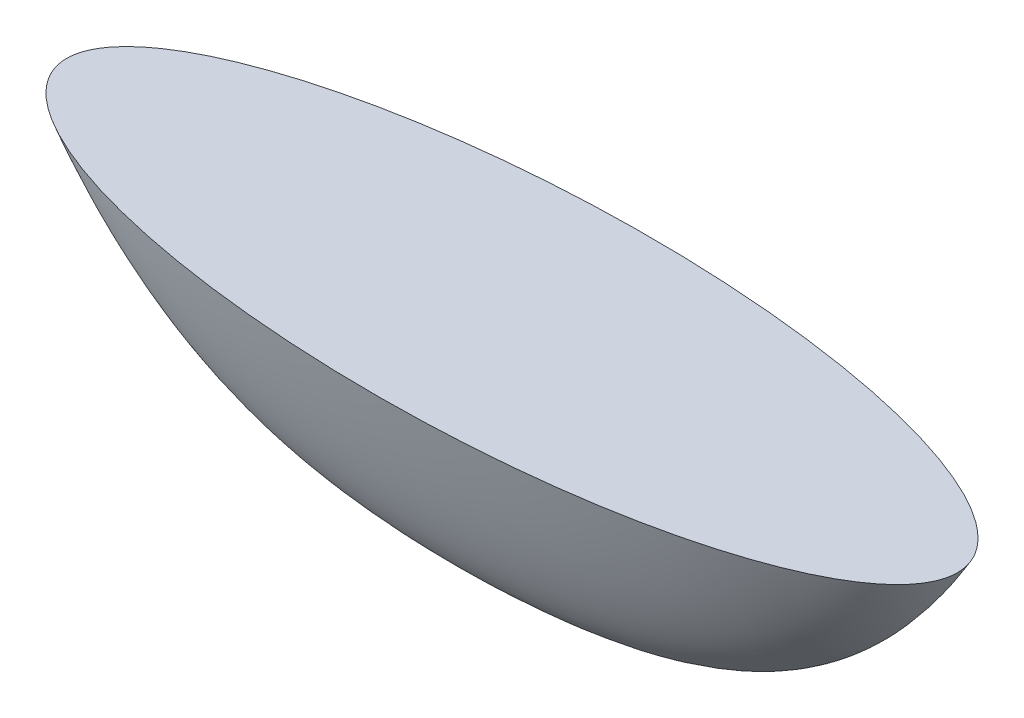
ISO-10303-21;
HEADER;
FILE_DESCRIPTION(('STEP AP214'),'2;1');
FILE_NAME('part.step','',(''),(''),'','','');
FILE_SCHEMA(('AUTOMOTIVE_DESIGN { 1 0 10303 214 1 1 1 1 }'));
ENDSEC;
DATA;
#1=APPLICATION_CONTEXT('core data for automotive mechanical design processes');
#2=APPLICATION_PROTOCOL_DEFINITION('international standard','automotive_design',2000,#1);
#3=PRODUCT_CONTEXT('',#1,'mechanical');
#4=PRODUCT('Part','Part','',(#3));
#5=PRODUCT_RELATED_PRODUCT_CATEGORY('part','',(#4));
#6=PRODUCT_DEFINITION_FORMATION('','',#4);
#7=PRODUCT_DEFINITION_CONTEXT('part definition',#1,'design');
#8=PRODUCT_DEFINITION('design','',#6,#7);
#9=PRODUCT_DEFINITION_SHAPE('','',#8);
#10=(LENGTH_UNIT() NAMED_UNIT(*) SI_UNIT(.MILLI.,.METRE.));
#11=(NAMED_UNIT(*) PLANE_ANGLE_UNIT() SI_UNIT($,.RADIAN.));
#12=(NAMED_UNIT(*) SI_UNIT($,.STERADIAN.) SOLID_ANGLE_UNIT());
#13=UNCERTAINTY_MEASURE_WITH_UNIT(LENGTH_MEASURE(1.E-05),#10,'distance_accuracy_value','');
#14=(GEOMETRIC_REPRESENTATION_CONTEXT(3) GLOBAL_UNCERTAINTY_ASSIGNED_CONTEXT((#13)) GLOBAL_UNIT_ASSIGNED_CONTEXT((#10,
#11,#12)) REPRESENTATION_CONTEXT('',''));
#15=CARTESIAN_POINT('',(0.,0.,0.));
#16=DIRECTION('',(0.,0.,1.));
#17=DIRECTION('',(1.,0.,0.));
#18=AXIS2_PLACEMENT_3D('',#15,#16,#17);
#19=CARTESIAN_POINT('',(0.,0.,0.));
#20=DIRECTION('',(0.,1.,0.));
#21=DIRECTION('',(-0.999851906711521,0.,0.0172094347767901));
#22=AXIS2_PLACEMENT_3D('',#19,#20,#21);
#23=PLANE('',#22);
#24=CARTESIAN_POINT('',(0.,0.,0.));
#25=VERTEX_POINT('',#24);
#26=VERTEX_LOOP('',#25);
#27=FACE_BOUND('',#26,.T.);
#28=CARTESIAN_POINT('',(0.,0.,0.));
#29=DIRECTION('',(0.,1.,0.));
#30=DIRECTION('',(-1.,0.,0.));
#31=AXIS2_PLACEMENT_3D('',#28,#29,#30);
#32=ELLIPSE('',#31,126.332421280006,38.8621430938494);
#33=CARTESIAN_POINT('',(-126.332421280006,0.,0.));
#34=VERTEX_POINT('',#33);
#35=EDGE_CURVE('E12',#34,#34,#32,.F.);
#36=ORIENTED_EDGE('',*,*,#35,.F.);
#37=EDGE_LOOP('',(#36));
#38=FACE_BOUND('',#37,.T.);
#39=ADVANCED_FACE('F219',(#27,#38),#23,.T.);
#40=CARTESIAN_POINT('',(-126.332421280006,0.,0.));
#41=CARTESIAN_POINT('',(-126.332421280006,0.,-0.724055720101464));
#42=CARTESIAN_POINT('',(-126.200860463796,0.,-2.17216716030439));
#43=CARTESIAN_POINT('',(-125.624698431712,0.,-4.27431763432497));
#44=CARTESIAN_POINT('',(-124.735718070539,0.,-6.2618180611774));
#45=CARTESIAN_POINT('',(-123.594716131777,0.,-8.11477548266345));
#46=CARTESIAN_POINT('',(-122.263209540154,0.,-9.83381615985682));
#47=CARTESIAN_POINT('',(-120.784667540636,0.,-11.4274833469121));
#48=CARTESIAN_POINT('',(-119.19397952282,0.,-12.9081222923523));
#49=CARTESIAN_POINT('',(-117.515189885834,0.,-14.2877678439713));
#50=CARTESIAN_POINT('',(-115.767106827956,0.,-15.5778467488719));
#51=CARTESIAN_POINT('',(-113.361189302801,0.,-17.1912359068653));
#52=CARTESIAN_POINT('',(-110.24049192765,0.,-19.0300917021699));
#53=CARTESIAN_POINT('',(-106.369906509327,0.,-21.0055987276352));
#54=CARTESIAN_POINT('',(-102.407507402115,0.,-22.7887468978894));
#55=CARTESIAN_POINT('',(-98.375965941823,0.,-24.4085858566371));
#56=CARTESIAN_POINT('',(-94.2906740634178,0.,-25.8871272813768));
#57=CARTESIAN_POINT('',(-90.1627119084947,0.,-27.2415166582752));
#58=CARTESIAN_POINT('',(-86.0001699883612,0.,-28.4852858201645));
#59=CARTESIAN_POINT('',(-81.8091941219328,0.,-29.6293297569872));
#60=CARTESIAN_POINT('',(-77.5945154366875,0.,-30.6825180132609));
#61=CARTESIAN_POINT('',(-73.3598781238327,0.,-31.6521784658335));
#62=CARTESIAN_POINT('',(-69.1082785471845,0.,-32.5444060360376));
#63=CARTESIAN_POINT('',(-64.8421724468865,0.,-33.3643455629932));
#64=CARTESIAN_POINT('',(-60.5635756165023,0.,-34.1163153375473));
#65=CARTESIAN_POINT('',(-56.2742087639832,0.,-34.804061849312));
#66=CARTESIAN_POINT('',(-50.5425720598916,0.,-35.6395309329596));
#67=CARTESIAN_POINT('',(-43.3578628253521,0.,-36.5381110423666));
#68=CARTESIAN_POINT('',(-34.7120526797566,0.,-37.4005087071854));
#69=CARTESIAN_POINT('',(-26.0484320277335,0.,-38.0595871907003));
#70=CARTESIAN_POINT('',(-17.3722649729313,0.,-38.524382198873));
#71=CARTESIAN_POINT('',(-8.68808456938262,0.,-38.8009359050651));
#72=CARTESIAN_POINT('',(1.52655665885959E-13,0.,-38.8927421977586));
#73=CARTESIAN_POINT('',(8.68808456938294,0.,-38.8009359050652));
#74=CARTESIAN_POINT('',(17.3722649729316,0.,-38.5243821988729));
#75=CARTESIAN_POINT('',(26.0484320277337,0.,-38.0595871907006));
#76=CARTESIAN_POINT('',(34.7120526797569,0.,-37.4005087071854));
#77=CARTESIAN_POINT('',(43.3578628253524,0.,-36.5381110423669));
#78=CARTESIAN_POINT('',(50.542572059892,0.,-35.6395309329597));
#79=CARTESIAN_POINT('',(56.2742087639834,0.,-34.8040618493122));
#80=CARTESIAN_POINT('',(60.5635756165026,0.,-34.1163153375475));
#81=CARTESIAN_POINT('',(64.8421724468867,0.,-33.3643455629935));
#82=CARTESIAN_POINT('',(69.1082785471846,0.,-32.5444060360379));
#83=CARTESIAN_POINT('',(73.359878123833,0.,-31.6521784658337));
#84=CARTESIAN_POINT('',(77.5945154366875,0.,-30.6825180132612));
#85=CARTESIAN_POINT('',(81.8091941219333,0.,-29.6293297569875));
#86=CARTESIAN_POINT('',(86.0001699883613,0.,-28.4852858201648));
#87=CARTESIAN_POINT('',(90.1627119084951,0.,-27.2415166582755));
#88=CARTESIAN_POINT('',(94.290674063418,0.,-25.8871272813771));
#89=CARTESIAN_POINT('',(98.3759659418232,0.,-24.4085858566375));
#90=CARTESIAN_POINT('',(102.407507402115,0.,-22.7887468978896));
#91=CARTESIAN_POINT('',(106.369906509328,0.,-21.0055987276356));
#92=CARTESIAN_POINT('',(110.24049192765,0.,-19.0300917021702));
#93=CARTESIAN_POINT('',(113.361189302801,0.,-17.1912359068657));
#94=CARTESIAN_POINT('',(115.767106827956,0.,-15.5778467488723));
#95=CARTESIAN_POINT('',(117.515189885834,0.,-14.2877678439717));
#96=CARTESIAN_POINT('',(119.19397952282,0.,-12.9081222923526));
#97=CARTESIAN_POINT('',(120.784667540636,0.,-11.4274833469123));
#98=CARTESIAN_POINT('',(122.263209540154,0.,-9.83381615985712));
#99=CARTESIAN_POINT('',(123.594716131778,0.,-8.11477548266365));
#100=CARTESIAN_POINT('',(124.735718070539,0.,-6.26181806117768));
#101=CARTESIAN_POINT('',(125.624698431712,0.,-4.27431763432524));
#102=CARTESIAN_POINT('',(126.200860463796,0.,-2.17216716030483));
#103=CARTESIAN_POINT('',(126.398201688111,0.,-4.38875840262687E-13));
#104=CARTESIAN_POINT('',(126.200860463796,0.,2.17216716030395));
#105=CARTESIAN_POINT('',(125.624698431712,0.,4.27431763432453));
#106=CARTESIAN_POINT('',(124.735718070538,0.,6.26181806117695));
#107=CARTESIAN_POINT('',(123.594716131777,0.,8.11477548266304));
#108=CARTESIAN_POINT('',(122.263209540154,0.,9.83381615985638));
#109=CARTESIAN_POINT('',(120.784667540636,0.,11.4274833469116));
#110=CARTESIAN_POINT('',(119.19397952282,0.,12.9081222923519));
#111=CARTESIAN_POINT('',(117.515189885834,0.,14.2877678439709));
#112=CARTESIAN_POINT('',(115.767106827956,0.,15.5778467488715));
#113=CARTESIAN_POINT('',(113.361189302801,0.,17.1912359068649));
#114=CARTESIAN_POINT('',(110.24049192765,0.,19.0300917021694));
#115=CARTESIAN_POINT('',(106.369906509327,0.,21.0055987276348));
#116=CARTESIAN_POINT('',(102.407507402115,0.,22.7887468978889));
#117=CARTESIAN_POINT('',(98.375965941823,0.,24.4085858566367));
#118=CARTESIAN_POINT('',(94.2906740634178,0.,25.8871272813765));
#119=CARTESIAN_POINT('',(90.1627119084948,0.,27.2415166582747));
#120=CARTESIAN_POINT('',(86.0001699883611,0.,28.4852858201642));
#121=CARTESIAN_POINT('',(81.8091941219329,0.,29.6293297569867));
#122=CARTESIAN_POINT('',(77.5945154366874,0.,30.6825180132605));
#123=CARTESIAN_POINT('',(73.3598781238327,0.,31.652178465833));
#124=CARTESIAN_POINT('',(69.1082785471844,0.,32.5444060360373));
#125=CARTESIAN_POINT('',(64.8421724468865,0.,33.3643455629927));
#126=CARTESIAN_POINT('',(60.5635756165023,0.,34.116315337547));
#127=CARTESIAN_POINT('',(56.2742087639831,0.,34.8040618493115));
#128=CARTESIAN_POINT('',(50.5425720598916,0.,35.6395309329592));
#129=CARTESIAN_POINT('',(43.3578628253519,0.,36.5381110423661));
#130=CARTESIAN_POINT('',(34.7120526797566,0.,37.400508707185));
#131=CARTESIAN_POINT('',(26.0484320277333,0.,38.0595871906999));
#132=CARTESIAN_POINT('',(17.3722649729313,0.,38.5243821988725));
#133=CARTESIAN_POINT('',(8.68808456938255,0.,38.8009359050647));
#134=CARTESIAN_POINT('',(-2.63677968348475E-13,0.,38.8927421977582));
#135=CARTESIAN_POINT('',(-8.68808456938301,0.,38.8009359050647));
#136=CARTESIAN_POINT('',(-17.3722649729317,0.,38.5243821988725));
#137=CARTESIAN_POINT('',(-26.0484320277337,0.,38.0595871907001));
#138=CARTESIAN_POINT('',(-34.712052679757,0.,37.400508707185));
#139=CARTESIAN_POINT('',(-43.3578628253523,0.,36.5381110423664));
#140=CARTESIAN_POINT('',(-50.542572059892,0.,35.6395309329593));
#141=CARTESIAN_POINT('',(-56.2742087639834,0.,34.8040618493118));
#142=CARTESIAN_POINT('',(-60.5635756165026,0.,34.1163153375471));
#143=CARTESIAN_POINT('',(-64.8421724468865,0.,33.3643455629931));
#144=CARTESIAN_POINT('',(-69.1082785471847,0.,32.5444060360375));
#145=CARTESIAN_POINT('',(-73.3598781238329,0.,31.6521784658333));
#146=CARTESIAN_POINT('',(-77.5945154366875,0.,30.6825180132607));
#147=CARTESIAN_POINT('',(-81.8091941219333,0.,29.629329756987));
#148=CARTESIAN_POINT('',(-86.0001699883613,0.,28.4852858201644));
#149=CARTESIAN_POINT('',(-90.162711908495,0.,27.241516658275));
#150=CARTESIAN_POINT('',(-94.2906740634182,0.,25.8871272813768));
#151=CARTESIAN_POINT('',(-98.375965941823,0.,24.408585856637));
#152=CARTESIAN_POINT('',(-102.407507402115,0.,22.7887468978892));
#153=CARTESIAN_POINT('',(-106.369906509328,0.,21.0055987276351));
#154=CARTESIAN_POINT('',(-110.24049192765,0.,19.0300917021698));
#155=CARTESIAN_POINT('',(-113.361189302801,0.,17.1912359068653));
#156=CARTESIAN_POINT('',(-115.767106827956,0.,15.5778467488718));
#157=CARTESIAN_POINT('',(-117.515189885834,0.,14.2877678439713));
#158=CARTESIAN_POINT('',(-119.19397952282,0.,12.9081222923521));
#159=CARTESIAN_POINT('',(-120.784667540636,0.,11.4274833469119));
#160=CARTESIAN_POINT('',(-122.263209540154,0.,9.83381615985668));
#161=CARTESIAN_POINT('',(-123.594716131777,0.,8.11477548266324));
#162=CARTESIAN_POINT('',(-124.735718070539,0.,6.26181806117721));
#163=CARTESIAN_POINT('',(-125.624698431712,0.,4.27431763432481));
#164=CARTESIAN_POINT('',(-126.200860463796,0.,2.17216716030439));
#165=CARTESIAN_POINT('',(-126.332421280006,0.,0.724055720101464));
#166=CARTESIAN_POINT('',(-126.332421280006,0.,0.));
#167=CARTESIAN_POINT('',(-97.7223167634216,-47.3587167274026,0.));
#168=CARTESIAN_POINT('',(-97.7223167634216,-47.3587167274026,-0.458568622730927));
#169=CARTESIAN_POINT('',(-97.6346707473142,-47.3587167274026,-1.37570586819278));
#170=CARTESIAN_POINT('',(-97.2505120759822,-47.3587167274026,-2.70706783507248));
#171=CARTESIAN_POINT('',(-96.6556680225836,-47.3587167274026,-3.96581810541235));
#172=CARTESIAN_POINT('',(-95.8888458916771,-47.3587167274026,-5.13935780568685));
#173=CARTESIAN_POINT('',(-94.9892090975291,-47.3587167274026,-6.22808356790932));
#174=CARTESIAN_POINT('',(-93.9844908572264,-47.3587167274026,-7.23740611971097));
#175=CARTESIAN_POINT('',(-92.8969904794535,-47.3587167274026,-8.1751441184898));
#176=CARTESIAN_POINT('',(-91.7421387789327,-47.3587167274026,-9.04891963451517));
#177=CARTESIAN_POINT('',(-90.5320503098468,-47.3587167274026,-9.86596960761887));
#178=CARTESIAN_POINT('',(-88.8561459583732,-47.3587167274026,-10.8877827410147));
#179=CARTESIAN_POINT('',(-86.6621446935528,-47.3587167274026,-12.0523914113743));
#180=CARTESIAN_POINT('',(-83.9075417989917,-47.3587167274026,-13.3035458608356));
#181=CARTESIAN_POINT('',(-81.0542511800381,-47.3587167274026,-14.43287303533));
#182=CARTESIAN_POINT('',(-78.1182529115623,-47.3587167274026,-15.4587710425369));
#183=CARTESIAN_POINT('',(-75.1109167812333,-47.3587167274026,-16.3951806115387));
#184=CARTESIAN_POINT('',(-72.0408817742519,-47.3587167274026,-17.252960550241));
#185=CARTESIAN_POINT('',(-68.9148934433035,-47.3587167274026,-18.0406810194376));
#186=CARTESIAN_POINT('',(-65.7384657025584,-47.3587167274026,-18.7652421794252));
#187=CARTESIAN_POINT('',(-62.5162164949429,-47.3587167274026,-19.4322614083986));
#188=CARTESIAN_POINT('',(-59.252138703746,-47.3587167274026,-20.0463796950279));
#189=CARTESIAN_POINT('',(-55.9497515882413,-47.3587167274026,-20.6114571561572));
#190=CARTESIAN_POINT('',(-52.6122320127106,-47.3587167274026,-21.1307521898957));
#191=CARTESIAN_POINT('',(-49.242478208601,-47.3587167274026,-21.60699971378));
#192=CARTESIAN_POINT('',(-45.8432015198057,-47.3587167274026,-22.0425725045643));
#193=CARTESIAN_POINT('',(-41.2748209529793,-47.3587167274026,-22.5717029242078));
#194=CARTESIAN_POINT('',(-35.5029282542621,-47.3587167274026,-23.1408036601655));
#195=CARTESIAN_POINT('',(-28.4964937875544,-47.3587167274026,-23.6869888478842));
#196=CARTESIAN_POINT('',(-21.4268893433466,-47.3587167274026,-24.1044052207769));
#197=CARTESIAN_POINT('',(-14.3104213514734,-47.3587167274026,-24.3987753926196));
#198=CARTESIAN_POINT('',(-7.16293324367945,-47.3587167274026,-24.573926073208));
#199=CARTESIAN_POINT('',(0.,-47.3587167274026,-24.6320700585805));
#200=CARTESIAN_POINT('',(7.16293324367962,-47.3587167274026,-24.573926073208));
#201=CARTESIAN_POINT('',(14.3104213514736,-47.3587167274026,-24.3987753926196));
#202=CARTESIAN_POINT('',(21.4268893433467,-47.3587167274026,-24.1044052207771));
#203=CARTESIAN_POINT('',(28.4964937875545,-47.3587167274026,-23.6869888478842));
#204=CARTESIAN_POINT('',(35.5029282542622,-47.3587167274026,-23.1408036601658));
#205=CARTESIAN_POINT('',(41.2748209529795,-47.3587167274026,-22.5717029242079));
#206=CARTESIAN_POINT('',(45.8432015198059,-47.3587167274026,-22.0425725045645));
#207=CARTESIAN_POINT('',(49.2424782086012,-47.3587167274026,-21.6069997137802));
#208=CARTESIAN_POINT('',(52.6122320127107,-47.3587167274026,-21.130752189896));
#209=CARTESIAN_POINT('',(55.9497515882414,-47.3587167274026,-20.6114571561575));
#210=CARTESIAN_POINT('',(59.2521387037461,-47.3587167274026,-20.0463796950281));
#211=CARTESIAN_POINT('',(62.516216494943,-47.3587167274026,-19.4322614083989));
#212=CARTESIAN_POINT('',(65.7384657025586,-47.3587167274026,-18.7652421794255));
#213=CARTESIAN_POINT('',(68.9148934433035,-47.3587167274026,-18.0406810194378));
#214=CARTESIAN_POINT('',(72.0408817742521,-47.3587167274026,-17.2529605502413));
#215=CARTESIAN_POINT('',(75.1109167812334,-47.3587167274026,-16.395180611539));
#216=CARTESIAN_POINT('',(78.1182529115625,-47.3587167274026,-15.4587710425372));
#217=CARTESIAN_POINT('',(81.0542511800381,-47.3587167274026,-14.4328730353302));
#218=CARTESIAN_POINT('',(83.9075417989919,-47.3587167274026,-13.303545860836));
#219=CARTESIAN_POINT('',(86.6621446935528,-47.3587167274026,-12.0523914113746));
#220=CARTESIAN_POINT('',(88.8561459583735,-47.3587167274026,-10.8877827410151));
#221=CARTESIAN_POINT('',(90.5320503098468,-47.3587167274026,-9.86596960761922));
#222=CARTESIAN_POINT('',(91.7421387789328,-47.3587167274026,-9.04891963451554));
#223=CARTESIAN_POINT('',(92.8969904794536,-47.3587167274026,-8.17514411849012));
#224=CARTESIAN_POINT('',(93.9844908572265,-47.3587167274026,-7.23740611971127));
#225=CARTESIAN_POINT('',(94.9892090975291,-47.3587167274026,-6.22808356790964));
#226=CARTESIAN_POINT('',(95.8888458916773,-47.3587167274026,-5.1393578056871));
#227=CARTESIAN_POINT('',(96.6556680225837,-47.3587167274026,-3.96581810541265));
#228=CARTESIAN_POINT('',(97.2505120759822,-47.3587167274026,-2.70706783507278));
#229=CARTESIAN_POINT('',(97.6346707473142,-47.3587167274026,-1.37570586819318));
#230=CARTESIAN_POINT('',(97.7661397714753,-47.3587167274026,-4.01642969347202E-13));
#231=CARTESIAN_POINT('',(97.6346707473143,-47.3587167274026,1.37570586819238));
#232=CARTESIAN_POINT('',(97.2505120759823,-47.3587167274026,2.70706783507208));
#233=CARTESIAN_POINT('',(96.6556680225836,-47.3587167274026,3.96581810541195));
#234=CARTESIAN_POINT('',(95.8888458916771,-47.3587167274026,5.13935780568647));
#235=CARTESIAN_POINT('',(94.9892090975292,-47.3587167274026,6.22808356790892));
#236=CARTESIAN_POINT('',(93.9844908572263,-47.3587167274026,7.23740611971057));
#237=CARTESIAN_POINT('',(92.8969904794536,-47.3587167274026,8.17514411848941));
#238=CARTESIAN_POINT('',(91.7421387789328,-47.3587167274026,9.04891963451477));
#239=CARTESIAN_POINT('',(90.5320503098466,-47.3587167274026,9.86596960761848));
#240=CARTESIAN_POINT('',(88.8561459583734,-47.3587167274026,10.8877827410143));
#241=CARTESIAN_POINT('',(86.6621446935527,-47.3587167274026,12.0523914113738));
#242=CARTESIAN_POINT('',(83.9075417989917,-47.3587167274026,13.3035458608353));
#243=CARTESIAN_POINT('',(81.054251180038,-47.3587167274026,14.4328730353295));
#244=CARTESIAN_POINT('',(78.1182529115624,-47.3587167274026,15.4587710425364));
#245=CARTESIAN_POINT('',(75.1109167812332,-47.3587167274026,16.3951806115383));
#246=CARTESIAN_POINT('',(72.040881774252,-47.3587167274026,17.2529605502405));
#247=CARTESIAN_POINT('',(68.9148934433034,-47.3587167274026,18.0406810194372));
#248=CARTESIAN_POINT('',(65.7384657025583,-47.3587167274026,18.7652421794248));
#249=CARTESIAN_POINT('',(62.5162164949429,-47.3587167274026,19.4322614083982));
#250=CARTESIAN_POINT('',(59.2521387037459,-47.3587167274026,20.0463796950275));
#251=CARTESIAN_POINT('',(55.9497515882413,-47.3587167274026,20.6114571561568));
#252=CARTESIAN_POINT('',(52.6122320127105,-47.3587167274026,21.1307521898953));
#253=CARTESIAN_POINT('',(49.242478208601,-47.3587167274026,21.6069997137796));
#254=CARTESIAN_POINT('',(45.8432015198057,-47.3587167274026,22.0425725045638));
#255=CARTESIAN_POINT('',(41.2748209529793,-47.3587167274026,22.5717029242074));
#256=CARTESIAN_POINT('',(35.502928254262,-47.3587167274026,23.1408036601651));
#257=CARTESIAN_POINT('',(28.4964937875544,-47.3587167274026,23.6869888478838));
#258=CARTESIAN_POINT('',(21.4268893433464,-47.3587167274026,24.1044052207765));
#259=CARTESIAN_POINT('',(14.3104213514734,-47.3587167274026,24.3987753926192));
#260=CARTESIAN_POINT('',(7.16293324367938,-47.3587167274026,24.5739260732076));
#261=CARTESIAN_POINT('',(-1.81712284108571E-13,-47.3587167274026,24.6320700585801));
#262=CARTESIAN_POINT('',(-7.16293324367967,-47.3587167274026,24.5739260732076));
#263=CARTESIAN_POINT('',(-14.3104213514736,-47.3587167274026,24.3987753926192));
#264=CARTESIAN_POINT('',(-21.4268893433467,-47.3587167274026,24.1044052207767));
#265=CARTESIAN_POINT('',(-28.4964937875546,-47.3587167274026,23.6869888478838));
#266=CARTESIAN_POINT('',(-35.5029282542622,-47.3587167274026,23.1408036601654));
#267=CARTESIAN_POINT('',(-41.2748209529795,-47.3587167274026,22.5717029242075));
#268=CARTESIAN_POINT('',(-45.8432015198058,-47.3587167274026,22.0425725045641));
#269=CARTESIAN_POINT('',(-49.2424782086012,-47.3587167274026,21.6069997137798));
#270=CARTESIAN_POINT('',(-52.6122320127106,-47.3587167274026,21.1307521898956));
#271=CARTESIAN_POINT('',(-55.9497515882415,-47.3587167274026,20.611457156157));
#272=CARTESIAN_POINT('',(-59.2521387037461,-47.3587167274026,20.0463796950278));
#273=CARTESIAN_POINT('',(-62.516216494943,-47.3587167274026,19.4322614083984));
#274=CARTESIAN_POINT('',(-65.7384657025586,-47.3587167274026,18.7652421794251));
#275=CARTESIAN_POINT('',(-68.9148934433035,-47.3587167274026,18.0406810194374));
#276=CARTESIAN_POINT('',(-72.040881774252,-47.3587167274026,17.2529605502409));
#277=CARTESIAN_POINT('',(-75.1109167812335,-47.3587167274026,16.3951806115386));
#278=CARTESIAN_POINT('',(-78.1182529115623,-47.3587167274026,15.4587710425367));
#279=CARTESIAN_POINT('',(-81.0542511800382,-47.3587167274026,14.4328730353298));
#280=CARTESIAN_POINT('',(-83.9075417989918,-47.3587167274026,13.3035458608356));
#281=CARTESIAN_POINT('',(-86.6621446935528,-47.3587167274026,12.0523914113742));
#282=CARTESIAN_POINT('',(-88.8561459583734,-47.3587167274026,10.8877827410147));
#283=CARTESIAN_POINT('',(-90.5320503098467,-47.3587167274026,9.86596960761881));
#284=CARTESIAN_POINT('',(-91.7421387789329,-47.3587167274026,9.04891963451514));
#285=CARTESIAN_POINT('',(-92.8969904794536,-47.3587167274026,8.17514411848969));
#286=CARTESIAN_POINT('',(-93.9844908572264,-47.3587167274026,7.23740611971086));
#287=CARTESIAN_POINT('',(-94.9892090975293,-47.3587167274026,6.22808356790924));
#288=CARTESIAN_POINT('',(-95.888845891677,-47.3587167274026,5.13935780568672));
#289=CARTESIAN_POINT('',(-96.6556680225839,-47.3587167274026,3.96581810541223));
#290=CARTESIAN_POINT('',(-97.2505120759822,-47.3587167274026,2.70706783507238));
#291=CARTESIAN_POINT('',(-97.6346707473144,-47.3587167274027,1.37570586819278));
#292=CARTESIAN_POINT('',(-97.7223167634216,-47.3587167274026,0.458568622730927));
#293=CARTESIAN_POINT('',(-97.7223167634216,-47.3587167274026,0.));
#294=CARTESIAN_POINT('',(-55.6115096700864,-65.4367412879308,0.));
#295=CARTESIAN_POINT('',(-55.6115096700864,-65.4367412879308,-0.265487097370537));
#296=CARTESIAN_POINT('',(-55.5610027300542,-65.4367412879308,-0.796461292111611));
#297=CARTESIAN_POINT('',(-55.3396437461763,-65.4367412879308,-1.56724979925249));
#298=CARTESIAN_POINT('',(-54.9969934086033,-65.4367412879308,-2.29599995576505));
#299=CARTESIAN_POINT('',(-54.5554501708384,-65.4367412879308,-2.9754176769766));
#300=CARTESIAN_POINT('',(-54.0376765498994,-65.4367412879308,-3.6057325919475));
#301=CARTESIAN_POINT('',(-53.4597175802267,-65.4367412879308,-4.19007722720109));
#302=CARTESIAN_POINT('',(-52.8344723492908,-65.4367412879308,-4.73297817386252));
#303=CARTESIAN_POINT('',(-52.1708634480579,-65.4367412879308,-5.23884820945615));
#304=CARTESIAN_POINT('',(-51.4758935271816,-65.4367412879308,-5.71187714125303));
#305=CARTESIAN_POINT('',(-50.5139194297109,-65.4367412879308,-6.30345316585062));
#306=CARTESIAN_POINT('',(-49.2555562791502,-65.4367412879308,-6.97770029079563));
#307=CARTESIAN_POINT('',(-47.6772999427932,-65.4367412879308,-7.70205286679958));
#308=CARTESIAN_POINT('',(-46.0441163300949,-65.4367412879308,-8.35587386255945));
#309=CARTESIAN_POINT('',(-44.3651687544691,-65.4367412879308,-8.94981481410028));
#310=CARTESIAN_POINT('',(-42.6469514156865,-65.4367412879308,-9.49194666983818));
#311=CARTESIAN_POINT('',(-40.8943775226153,-65.4367412879308,-9.98855610803424));
#312=CARTESIAN_POINT('',(-39.1112640863516,-65.4367412879308,-10.444604800727));
#313=CARTESIAN_POINT('',(-37.3007150641143,-65.4367412879308,-10.864087577562));
#314=CARTESIAN_POINT('',(-35.4653156929286,-65.4367412879308,-11.2502566048623));
#315=CARTESIAN_POINT('',(-33.6072893331873,-65.4367412879308,-11.6057987708056));
#316=CARTESIAN_POINT('',(-31.728585141906,-65.4367412879308,-11.9329488798805));
#317=CARTESIAN_POINT('',(-29.8309540474208,-65.4367412879308,-12.2335933730975));
#318=CARTESIAN_POINT('',(-27.9159856643216,-65.4367412879308,-12.5093156237674));
#319=CARTESIAN_POINT('',(-25.9851614091405,-65.4367412879308,-12.7614893447477));
#320=CARTESIAN_POINT('',(-23.3914109070536,-65.4367412879308,-13.0678280087519));
#321=CARTESIAN_POINT('',(-20.116314840991,-65.4367412879308,-13.3973073822011));
#322=CARTESIAN_POINT('',(-16.143321626864,-65.4367412879308,-13.7135198593014));
#323=CARTESIAN_POINT('',(-12.1365822046488,-65.4367412879308,-13.9551819699235));
#324=CARTESIAN_POINT('',(-8.10483066794947,-65.4367412879308,-14.1256068062534));
#325=CARTESIAN_POINT('',(-4.05653305884405,-65.4367412879308,-14.2270098318572));
#326=CARTESIAN_POINT('',(0.,-65.4367412879308,-14.2606721391782));
#327=CARTESIAN_POINT('',(4.05653305884414,-65.4367412879308,-14.2270098318573));
#328=CARTESIAN_POINT('',(8.10483066794955,-65.4367412879308,-14.1256068062534));
#329=CARTESIAN_POINT('',(12.1365822046489,-65.4367412879308,-13.9551819699236));
#330=CARTESIAN_POINT('',(16.1433216268641,-65.4367412879308,-13.7135198593013));
#331=CARTESIAN_POINT('',(20.1163148409911,-65.4367412879308,-13.3973073822012));
#332=CARTESIAN_POINT('',(23.3914109070537,-65.4367412879308,-13.0678280087519));
#333=CARTESIAN_POINT('',(25.9851614091406,-65.4367412879308,-12.7614893447479));
#334=CARTESIAN_POINT('',(27.9159856643217,-65.4367412879308,-12.5093156237675));
#335=CARTESIAN_POINT('',(29.8309540474209,-65.4367412879308,-12.2335933730977));
#336=CARTESIAN_POINT('',(31.728585141906,-65.4367412879308,-11.9329488798806));
#337=CARTESIAN_POINT('',(33.6072893331873,-65.4367412879308,-11.6057987708058));
#338=CARTESIAN_POINT('',(35.4653156929286,-65.4367412879308,-11.2502566048625));
#339=CARTESIAN_POINT('',(37.3007150641144,-65.4367412879308,-10.8640875775621));
#340=CARTESIAN_POINT('',(39.1112640863516,-65.4367412879308,-10.4446048007272));
#341=CARTESIAN_POINT('',(40.8943775226154,-65.4367412879308,-9.98855610803442));
#342=CARTESIAN_POINT('',(42.6469514156865,-65.4367412879308,-9.49194666983833));
#343=CARTESIAN_POINT('',(44.3651687544692,-65.4367412879308,-8.94981481410047));
#344=CARTESIAN_POINT('',(46.044116330095,-65.4367412879308,-8.35587386255959));
#345=CARTESIAN_POINT('',(47.6772999427933,-65.4367412879308,-7.70205286679978));
#346=CARTESIAN_POINT('',(49.2555562791501,-65.4367412879308,-6.9777002907958));
#347=CARTESIAN_POINT('',(50.513919429711,-65.4367412879308,-6.30345316585082));
#348=CARTESIAN_POINT('',(51.4758935271815,-65.4367412879308,-5.71187714125323));
#349=CARTESIAN_POINT('',(52.1708634480579,-65.4367412879308,-5.23884820945636));
#350=CARTESIAN_POINT('',(52.8344723492909,-65.4367412879308,-4.7329781738627));
#351=CARTESIAN_POINT('',(53.4597175802267,-65.4367412879308,-4.19007722720125));
#352=CARTESIAN_POINT('',(54.0376765498994,-65.4367412879308,-3.60573259194768));
#353=CARTESIAN_POINT('',(54.5554501708385,-65.4367412879308,-2.97541767697674));
#354=CARTESIAN_POINT('',(54.9969934086033,-65.4367412879308,-2.29599995576521));
#355=CARTESIAN_POINT('',(55.3396437461762,-65.4367412879308,-1.56724979925265));
#356=CARTESIAN_POINT('',(55.5610027300541,-65.4367412879308,-0.796461292111836));
#357=CARTESIAN_POINT('',(55.6367631401025,-65.4367412879308,-2.25794183514251E-13));
#358=CARTESIAN_POINT('',(55.5610027300542,-65.4367412879308,0.796461292111385));
#359=CARTESIAN_POINT('',(55.3396437461763,-65.4367412879308,1.56724979925226));
#360=CARTESIAN_POINT('',(54.9969934086033,-65.4367412879308,2.29599995576482));
#361=CARTESIAN_POINT('',(54.5554501708383,-65.4367412879308,2.97541767697638));
#362=CARTESIAN_POINT('',(54.0376765498994,-65.4367412879308,3.60573259194727));
#363=CARTESIAN_POINT('',(53.4597175802266,-65.4367412879308,4.19007722720086));
#364=CARTESIAN_POINT('',(52.8344723492908,-65.4367412879308,4.7329781738623));
#365=CARTESIAN_POINT('',(52.1708634480579,-65.4367412879308,5.23884820945592));
#366=CARTESIAN_POINT('',(51.4758935271814,-65.4367412879308,5.71187714125281));
#367=CARTESIAN_POINT('',(50.513919429711,-65.4367412879308,6.30345316585042));
#368=CARTESIAN_POINT('',(49.25555627915,-65.4367412879308,6.97770029079539));
#369=CARTESIAN_POINT('',(47.6772999427932,-65.4367412879308,7.70205286679937));
#370=CARTESIAN_POINT('',(46.0441163300949,-65.4367412879308,8.35587386255921));
#371=CARTESIAN_POINT('',(44.3651687544691,-65.4367412879308,8.94981481410005));
#372=CARTESIAN_POINT('',(42.6469514156865,-65.4367412879308,9.49194666983797));
#373=CARTESIAN_POINT('',(40.8943775226153,-65.4367412879308,9.988556108034));
#374=CARTESIAN_POINT('',(39.1112640863515,-65.4367412879308,10.4446048007268));
#375=CARTESIAN_POINT('',(37.3007150641143,-65.4367412879308,10.8640875775617));
#376=CARTESIAN_POINT('',(35.4653156929286,-65.4367412879308,11.2502566048621));
#377=CARTESIAN_POINT('',(33.6072893331872,-65.4367412879308,11.6057987708054));
#378=CARTESIAN_POINT('',(31.7285851419059,-65.4367412879308,11.9329488798803));
#379=CARTESIAN_POINT('',(29.8309540474208,-65.4367412879308,12.2335933730973));
#380=CARTESIAN_POINT('',(27.9159856643216,-65.4367412879308,12.5093156237672));
#381=CARTESIAN_POINT('',(25.9851614091405,-65.4367412879308,12.7614893447475));
#382=CARTESIAN_POINT('',(23.3914109070536,-65.4367412879308,13.0678280087517));
#383=CARTESIAN_POINT('',(20.1163148409909,-65.4367412879308,13.3973073822009));
#384=CARTESIAN_POINT('',(16.143321626864,-65.4367412879308,13.7135198593011));
#385=CARTESIAN_POINT('',(12.1365822046487,-65.4367412879308,13.9551819699233));
#386=CARTESIAN_POINT('',(8.10483066794944,-65.4367412879308,14.1256068062532));
#387=CARTESIAN_POINT('',(4.056533058844,-65.4367412879308,14.227009831857));
#388=CARTESIAN_POINT('',(-1.0842021724855E-13,-65.4367412879308,14.260672139178));
#389=CARTESIAN_POINT('',(-4.05653305884418,-65.4367412879308,14.227009831857));
#390=CARTESIAN_POINT('',(-8.10483066794961,-65.4367412879308,14.1256068062532));
#391=CARTESIAN_POINT('',(-12.1365822046489,-65.4367412879308,13.9551819699233));
#392=CARTESIAN_POINT('',(-16.1433216268641,-65.4367412879308,13.7135198593012));
#393=CARTESIAN_POINT('',(-20.1163148409911,-65.4367412879308,13.397307382201));
#394=CARTESIAN_POINT('',(-23.3914109070537,-65.4367412879308,13.0678280087517));
#395=CARTESIAN_POINT('',(-25.9851614091405,-65.4367412879308,12.7614893447477));
#396=CARTESIAN_POINT('',(-27.9159856643217,-65.4367412879308,12.5093156237672));
#397=CARTESIAN_POINT('',(-29.8309540474208,-65.4367412879308,12.2335933730975));
#398=CARTESIAN_POINT('',(-31.7285851419061,-65.4367412879308,11.9329488798804));
#399=CARTESIAN_POINT('',(-33.6072893331873,-65.4367412879308,11.6057987708056));
#400=CARTESIAN_POINT('',(-35.4653156929286,-65.4367412879308,11.2502566048622));
#401=CARTESIAN_POINT('',(-37.3007150641144,-65.4367412879308,10.8640875775619));
#402=CARTESIAN_POINT('',(-39.1112640863516,-65.4367412879308,10.4446048007269));
#403=CARTESIAN_POINT('',(-40.8943775226154,-65.4367412879308,9.98855610803417));
#404=CARTESIAN_POINT('',(-42.6469514156866,-65.4367412879308,9.49194666983814));
#405=CARTESIAN_POINT('',(-44.3651687544692,-65.4367412879308,8.94981481410022));
#406=CARTESIAN_POINT('',(-46.044116330095,-65.4367412879308,8.35587386255938));
#407=CARTESIAN_POINT('',(-47.6772999427933,-65.4367412879308,7.70205286679954));
#408=CARTESIAN_POINT('',(-49.2555562791502,-65.4367412879308,6.97770029079558));
#409=CARTESIAN_POINT('',(-50.513919429711,-65.4367412879308,6.30345316585059));
#410=CARTESIAN_POINT('',(-51.4758935271815,-65.4367412879308,5.71187714125299));
#411=CARTESIAN_POINT('',(-52.170863448058,-65.4367412879308,5.23884820945613));
#412=CARTESIAN_POINT('',(-52.8344723492909,-65.4367412879308,4.73297817386245));
#413=CARTESIAN_POINT('',(-53.4597175802267,-65.4367412879308,4.19007722720102));
#414=CARTESIAN_POINT('',(-54.0376765498995,-65.4367412879308,3.60573259194745));
#415=CARTESIAN_POINT('',(-54.5554501708383,-65.4367412879308,2.97541767697652));
#416=CARTESIAN_POINT('',(-54.9969934086034,-65.4367412879308,2.29599995576498));
#417=CARTESIAN_POINT('',(-55.3396437461762,-65.4367412879308,1.56724979925243));
#418=CARTESIAN_POINT('',(-55.5610027300543,-65.4367412879309,0.79646129211161));
#419=CARTESIAN_POINT('',(-55.6115096700864,-65.4367412879308,0.265487097370537));
#420=CARTESIAN_POINT('',(-55.6115096700864,-65.4367412879308,0.));
#421=CARTESIAN_POINT('',(0.,-54.2340736815845,0.));
#422=CARTESIAN_POINT('',(0.,-54.2340736815845,0.));
#423=CARTESIAN_POINT('',(0.,-54.2340736815845,0.));
#424=CARTESIAN_POINT('',(0.,-54.2340736815845,0.));
#425=CARTESIAN_POINT('',(0.,-54.2340736815845,0.));
#426=CARTESIAN_POINT('',(0.,-54.2340736815845,0.));
#427=CARTESIAN_POINT('',(0.,-54.2340736815845,0.));
#428=CARTESIAN_POINT('',(0.,-54.2340736815845,0.));
#429=CARTESIAN_POINT('',(0.,-54.2340736815845,0.));
#430=CARTESIAN_POINT('',(0.,-54.2340736815845,0.));
#431=CARTESIAN_POINT('',(0.,-54.2340736815845,0.));
#432=CARTESIAN_POINT('',(0.,-54.2340736815845,0.));
#433=CARTESIAN_POINT('',(0.,-54.2340736815845,0.));
#434=CARTESIAN_POINT('',(0.,-54.2340736815845,0.));
#435=CARTESIAN_POINT('',(0.,-54.2340736815845,0.));
#436=CARTESIAN_POINT('',(0.,-54.2340736815845,0.));
#437=CARTESIAN_POINT('',(0.,-54.2340736815845,0.));
#438=CARTESIAN_POINT('',(0.,-54.2340736815845,0.));
#439=CARTESIAN_POINT('',(0.,-54.2340736815845,0.));
#440=CARTESIAN_POINT('',(0.,-54.2340736815845,0.));
#441=CARTESIAN_POINT('',(0.,-54.2340736815845,0.));
#442=CARTESIAN_POINT('',(0.,-54.2340736815845,0.));
#443=CARTESIAN_POINT('',(0.,-54.2340736815845,0.));
#444=CARTESIAN_POINT('',(0.,-54.2340736815845,0.));
#445=CARTESIAN_POINT('',(0.,-54.2340736815845,0.));
#446=CARTESIAN_POINT('',(0.,-54.2340736815845,0.));
#447=CARTESIAN_POINT('',(0.,-54.2340736815845,0.));
#448=CARTESIAN_POINT('',(0.,-54.2340736815845,0.));
#449=CARTESIAN_POINT('',(0.,-54.2340736815845,0.));
#450=CARTESIAN_POINT('',(0.,-54.2340736815845,0.));
#451=CARTESIAN_POINT('',(0.,-54.2340736815845,0.));
#452=CARTESIAN_POINT('',(0.,-54.2340736815845,0.));
#453=CARTESIAN_POINT('',(0.,-54.2340736815845,0.));
#454=CARTESIAN_POINT('',(0.,-54.2340736815845,0.));
#455=CARTESIAN_POINT('',(0.,-54.2340736815845,0.));
#456=CARTESIAN_POINT('',(0.,-54.2340736815845,0.));
#457=CARTESIAN_POINT('',(0.,-54.2340736815845,0.));
#458=CARTESIAN_POINT('',(0.,-54.2340736815845,0.));
#459=CARTESIAN_POINT('',(0.,-54.2340736815845,0.));
#460=CARTESIAN_POINT('',(0.,-54.2340736815845,0.));
#461=CARTESIAN_POINT('',(0.,-54.2340736815845,0.));
#462=CARTESIAN_POINT('',(0.,-54.2340736815845,0.));
#463=CARTESIAN_POINT('',(0.,-54.2340736815845,0.));
#464=CARTESIAN_POINT('',(0.,-54.2340736815845,0.));
#465=CARTESIAN_POINT('',(0.,-54.2340736815845,0.));
#466=CARTESIAN_POINT('',(0.,-54.2340736815845,0.));
#467=CARTESIAN_POINT('',(0.,-54.2340736815845,0.));
#468=CARTESIAN_POINT('',(0.,-54.2340736815845,0.));
#469=CARTESIAN_POINT('',(0.,-54.2340736815845,0.));
#470=CARTESIAN_POINT('',(0.,-54.2340736815845,0.));
#471=CARTESIAN_POINT('',(0.,-54.2340736815845,0.));
#472=CARTESIAN_POINT('',(0.,-54.2340736815845,0.));
#473=CARTESIAN_POINT('',(0.,-54.2340736815845,0.));
#474=CARTESIAN_POINT('',(0.,-54.2340736815845,0.));
#475=CARTESIAN_POINT('',(0.,-54.2340736815845,0.));
#476=CARTESIAN_POINT('',(0.,-54.2340736815845,0.));
#477=CARTESIAN_POINT('',(0.,-54.2340736815845,0.));
#478=CARTESIAN_POINT('',(0.,-54.2340736815845,0.));
#479=CARTESIAN_POINT('',(0.,-54.2340736815845,0.));
#480=CARTESIAN_POINT('',(0.,-54.2340736815845,0.));
#481=CARTESIAN_POINT('',(0.,-54.2340736815845,0.));
#482=CARTESIAN_POINT('',(0.,-54.2340736815845,0.));
#483=CARTESIAN_POINT('',(0.,-54.2340736815845,0.));
#484=CARTESIAN_POINT('',(0.,-54.2340736815845,0.));
#485=CARTESIAN_POINT('',(0.,-54.2340736815845,0.));
#486=CARTESIAN_POINT('',(0.,-54.2340736815845,0.));
#487=CARTESIAN_POINT('',(0.,-54.2340736815845,0.));
#488=CARTESIAN_POINT('',(0.,-54.2340736815845,0.));
#489=CARTESIAN_POINT('',(0.,-54.2340736815845,0.));
#490=CARTESIAN_POINT('',(0.,-54.2340736815845,0.));
#491=CARTESIAN_POINT('',(0.,-54.2340736815845,0.));
#492=CARTESIAN_POINT('',(0.,-54.2340736815845,0.));
#493=CARTESIAN_POINT('',(0.,-54.2340736815845,0.));
#494=CARTESIAN_POINT('',(0.,-54.2340736815845,0.));
#495=CARTESIAN_POINT('',(0.,-54.2340736815845,0.));
#496=CARTESIAN_POINT('',(0.,-54.2340736815845,0.));
#497=CARTESIAN_POINT('',(0.,-54.2340736815845,0.));
#498=CARTESIAN_POINT('',(0.,-54.2340736815845,0.));
#499=CARTESIAN_POINT('',(0.,-54.2340736815845,0.));
#500=CARTESIAN_POINT('',(0.,-54.2340736815845,0.));
#501=CARTESIAN_POINT('',(0.,-54.2340736815845,0.));
#502=CARTESIAN_POINT('',(0.,-54.2340736815845,0.));
#503=CARTESIAN_POINT('',(0.,-54.2340736815845,0.));
#504=CARTESIAN_POINT('',(0.,-54.2340736815845,0.));
#505=CARTESIAN_POINT('',(0.,-54.2340736815845,0.));
#506=CARTESIAN_POINT('',(0.,-54.2340736815845,0.));
#507=CARTESIAN_POINT('',(0.,-54.2340736815845,0.));
#508=CARTESIAN_POINT('',(0.,-54.2340736815845,0.));
#509=CARTESIAN_POINT('',(0.,-54.2340736815845,0.));
#510=CARTESIAN_POINT('',(0.,-54.2340736815845,0.));
#511=CARTESIAN_POINT('',(0.,-54.2340736815845,0.));
#512=CARTESIAN_POINT('',(0.,-54.2340736815845,0.));
#513=CARTESIAN_POINT('',(0.,-54.2340736815845,0.));
#514=CARTESIAN_POINT('',(0.,-54.2340736815845,0.));
#515=CARTESIAN_POINT('',(0.,-54.2340736815845,0.));
#516=CARTESIAN_POINT('',(0.,-54.2340736815845,0.));
#517=CARTESIAN_POINT('',(0.,-54.2340736815845,0.));
#518=CARTESIAN_POINT('',(0.,-54.2340736815845,0.));
#519=CARTESIAN_POINT('',(0.,-54.2340736815845,0.));
#520=CARTESIAN_POINT('',(0.,-54.2340736815845,0.));
#521=CARTESIAN_POINT('',(0.,-54.2340736815845,0.));
#522=CARTESIAN_POINT('',(0.,-54.2340736815845,0.));
#523=CARTESIAN_POINT('',(0.,-54.2340736815845,0.));
#524=CARTESIAN_POINT('',(0.,-54.2340736815845,0.));
#525=CARTESIAN_POINT('',(0.,-54.2340736815845,0.));
#526=CARTESIAN_POINT('',(0.,-54.2340736815845,0.));
#527=CARTESIAN_POINT('',(0.,-54.2340736815845,0.));
#528=CARTESIAN_POINT('',(0.,-54.2340736815845,0.));
#529=CARTESIAN_POINT('',(0.,-54.2340736815845,0.));
#530=CARTESIAN_POINT('',(0.,-54.2340736815845,0.));
#531=CARTESIAN_POINT('',(0.,-54.2340736815845,0.));
#532=CARTESIAN_POINT('',(0.,-54.2340736815845,0.));
#533=CARTESIAN_POINT('',(0.,-54.2340736815845,0.));
#534=CARTESIAN_POINT('',(0.,-54.2340736815845,0.));
#535=CARTESIAN_POINT('',(0.,-54.2340736815845,0.));
#536=CARTESIAN_POINT('',(0.,-54.2340736815845,0.));
#537=CARTESIAN_POINT('',(0.,-54.2340736815845,0.));
#538=CARTESIAN_POINT('',(0.,-54.2340736815845,0.));
#539=CARTESIAN_POINT('',(0.,-54.2340736815845,0.));
#540=CARTESIAN_POINT('',(0.,-54.2340736815845,0.));
#541=CARTESIAN_POINT('',(0.,-54.2340736815845,0.));
#542=CARTESIAN_POINT('',(0.,-54.2340736815845,0.));
#543=CARTESIAN_POINT('',(0.,-54.2340736815845,0.));
#544=CARTESIAN_POINT('',(0.,-54.2340736815845,0.));
#545=CARTESIAN_POINT('',(0.,-54.2340736815846,0.));
#546=CARTESIAN_POINT('',(0.,-54.2340736815845,0.));
#547=CARTESIAN_POINT('',(0.,-54.2340736815845,0.));
#548=B_SPLINE_SURFACE_WITH_KNOTS('',3,3,((#40,#41,#42,#43,#44,#45,#46,#47,#48,#49,#50,#51,#52,
#53,#54,#55,#56,#57,#58,#59,#60,#61,#62,#63,#64,#65,#66,#67,#68,#69,#70,#71,#72,#73,#74,#75,#76,
#77,#78,#79,#80,#81,#82,#83,#84,#85,#86,#87,#88,#89,#90,#91,#92,#93,#94,#95,#96,#97,#98,#99,
#100,#101,#102,#103,#104,#105,#106,#107,#108,#109,#110,#111,#112,#113,#114,#115,#116,#117,#118,
#119,#120,#121,#122,#123,#124,#125,#126,#127,#128,#129,#130,#131,#132,#133,#134,#135,#136,#137,
#138,#139,#140,#141,#142,#143,#144,#145,#146,#147,#148,#149,#150,#151,#152,#153,#154,#155,#156,
#157,#158,#159,#160,#161,#162,#163,#164,#165,#166),(#167,#168,#169,#170,#171,#172,#173,#174,
#175,#176,#177,#178,#179,#180,#181,#182,#183,#184,#185,#186,#187,#188,#189,#190,#191,#192,#193,
#194,#195,#196,#197,#198,#199,#200,#201,#202,#203,#204,#205,#206,#207,#208,#209,#210,#211,#212,
#213,#214,#215,#216,#217,#218,#219,#220,#221,#222,#223,#224,#225,#226,#227,#228,#229,#230,#231,
#232,#233,#234,#235,#236,#237,#238,#239,#240,#241,#242,#243,#244,#245,#246,#247,#248,#249,#250,
#251,#252,#253,#254,#255,#256,#257,#258,#259,#260,#261,#262,#263,#264,#265,#266,#267,#268,#269,
#270,#271,#272,#273,#274,#275,#276,#277,#278,#279,#280,#281,#282,#283,#284,#285,#286,#287,#288,
#289,#290,#291,#292,#293),(#294,#295,#296,#297,#298,#299,#300,#301,#302,#303,#304,#305,#306,
#307,#308,#309,#310,#311,#312,#313,#314,#315,#316,#317,#318,#319,#320,#321,#322,#323,#324,#325,
#326,#327,#328,#329,#330,#331,#332,#333,#334,#335,#336,#337,#338,#339,#340,#341,#342,#343,#344,
#345,#346,#347,#348,#349,#350,#351,#352,#353,#354,#355,#356,#357,#358,#359,#360,#361,#362,#363,
#364,#365,#366,#367,#368,#369,#370,#371,#372,#373,#374,#375,#376,#377,#378,#379,#380,#381,#382,
#383,#384,#385,#386,#387,#388,#389,#390,#391,#392,#393,#394,#395,#396,#397,#398,#399,#400,#401,
#402,#403,#404,#405,#406,#407,#408,#409,#410,#411,#412,#413,#414,#415,#416,#417,#418,#419,#420),
(#421,#422,#423,#424,#425,#426,#427,#428,#429,#430,#431,#432,#433,#434,#435,#436,#437,#438,#439,
#440,#441,#442,#443,#444,#445,#446,#447,#448,#449,#450,#451,#452,#453,#454,#455,#456,#457,#458,
#459,#460,#461,#462,#463,#464,#465,#466,#467,#468,#469,#470,#471,#472,#473,#474,#475,#476,#477,
#478,#479,#480,#481,#482,#483,#484,#485,#486,#487,#488,#489,#490,#491,#492,#493,#494,#495,#496,
#497,#498,#499,#500,#501,#502,#503,#504,#505,#506,#507,#508,#509,#510,#511,#512,#513,#514,#515,
#516,#517,#518,#519,#520,#521,#522,#523,#524,#525,#526,#527,#528,#529,#530,#531,#532,#533,#534,
#535,#536,#537,#538,#539,#540,#541,#542,#543,#544,#545,#546,#547)),.UNSPECIFIED.,.F.,.T.,.F.,(4,
4),(4,1,1,1,1,1,1,1,1,1,1,1,1,1,1,1,1,1,1,1,1,1,1,1,1,1,1,1,1,1,1,1,1,1,1,1,1,1,1,1,1,1,1,1,1,1,
1,1,1,1,1,1,1,1,1,1,1,1,1,1,1,1,1,1,1,1,1,1,1,1,1,1,1,1,1,1,1,1,1,1,1,1,1,1,1,1,1,1,1,1,1,1,1,1,
1,1,1,1,1,1,1,1,1,1,1,1,1,1,1,1,1,1,1,1,1,1,1,1,1,1,1,1,1,1,4),(0.,0.4506),(0.,0.00390625,
0.0078125,0.01171875,0.015625,0.01953125,0.0234375,0.02734375,0.03125,0.03515625,0.0390625,
0.046875,0.0546875,0.0625,0.0703125,0.078125,0.0859375,0.09375,0.1015625,0.109375,0.1171875,
0.125,0.1328125,0.140625,0.1484375,0.15625,0.171875,0.1875,0.203125,0.21875,0.234375,0.25,
0.265625,0.28125,0.296875,0.3125,0.328125,0.34375,0.3515625,0.359375,0.3671875,0.375,0.3828125,
0.390625,0.3984375,0.40625,0.4140625,0.421875,0.4296875,0.4375,0.4453125,0.453125,0.4609375,
0.46484375,0.46875,0.47265625,0.4765625,0.48046875,0.484375,0.48828125,0.4921875,0.49609375,0.5,
0.50390625,0.5078125,0.51171875,0.515625,0.51953125,0.5234375,0.52734375,0.53125,0.53515625,
0.5390625,0.546875,0.5546875,0.5625,0.5703125,0.578125,0.5859375,0.59375,0.6015625,0.609375,
0.6171875,0.625,0.6328125,0.640625,0.6484375,0.65625,0.671875,0.6875,0.703125,0.71875,0.734375,
0.75,0.765625,0.78125,0.796875,0.8125,0.828125,0.84375,0.8515625,0.859375,0.8671875,0.875,
0.8828125,0.890625,0.8984375,0.90625,0.9140625,0.921875,0.9296875,0.9375,0.9453125,0.953125,
0.9609375,0.96484375,0.96875,0.97265625,0.9765625,0.98046875,0.984375,0.98828125,0.9921875,
0.99609375,1.),.UNSPECIFIED.);
#549=ORIENTED_EDGE('',*,*,#35,.T.);
#550=EDGE_LOOP('',(#549));
#551=FACE_BOUND('',#550,.T.);
#552=CARTESIAN_POINT('',(0.,-54.2340736815845,0.));
#553=VERTEX_POINT('',#552);
#554=VERTEX_LOOP('',#553);
#555=FACE_BOUND('',#554,.T.);
#556=ADVANCED_FACE('F233',(#551,#555),#548,.F.);
#557=CLOSED_SHELL('',(#39,#556));
#558=MANIFOLD_SOLID_BREP('B2',#557);
#559=ADVANCED_BREP_SHAPE_REPRESENTATION('',(#18,#558),#14);
#560=SHAPE_DEFINITION_REPRESENTATION(#9,#559);
ENDSEC;
END-ISO-10303-21;
